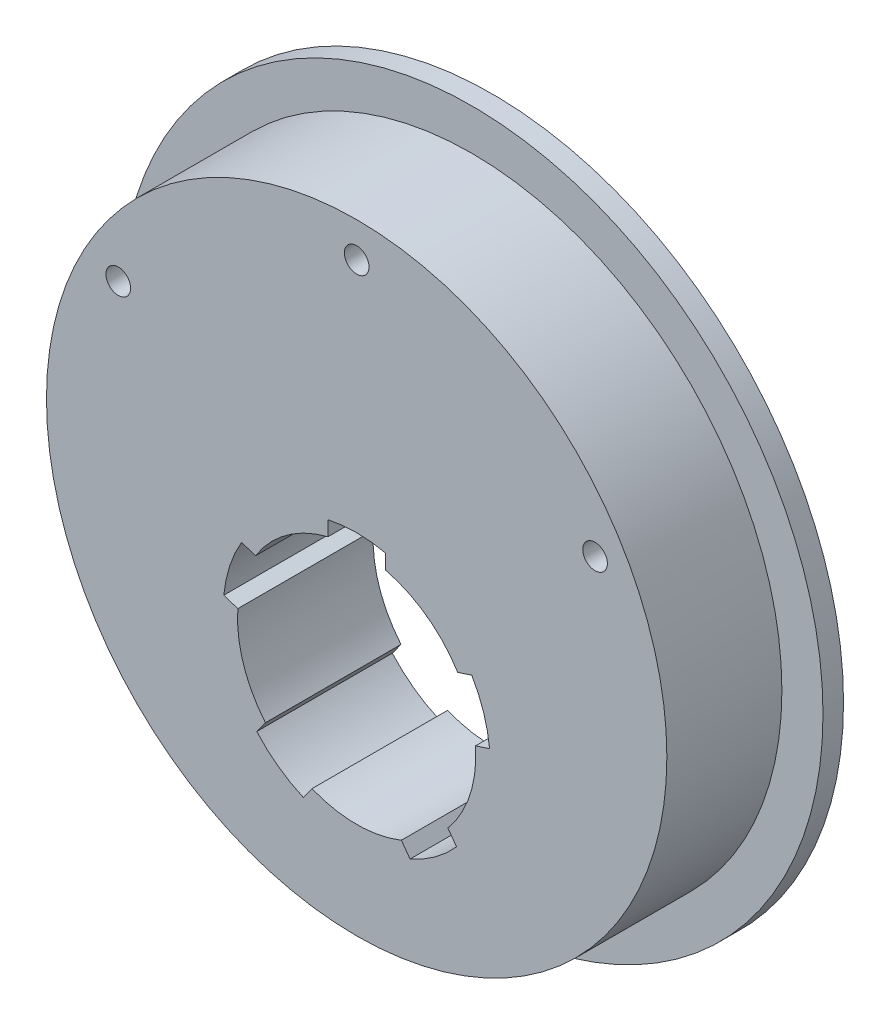
ISO-10303-21;
HEADER;
FILE_DESCRIPTION(('STEP AP214'),'2;1');
FILE_NAME('part.step','',(''),(''),'','','');
FILE_SCHEMA(('AUTOMOTIVE_DESIGN { 1 0 10303 214 1 1 1 1 }'));
ENDSEC;
DATA;
#1=APPLICATION_CONTEXT('core data for automotive mechanical design processes');
#2=APPLICATION_PROTOCOL_DEFINITION('international standard','automotive_design',2000,#1);
#3=PRODUCT_CONTEXT('',#1,'mechanical');
#4=PRODUCT('Part','Part','',(#3));
#5=PRODUCT_RELATED_PRODUCT_CATEGORY('part','',(#4));
#6=PRODUCT_DEFINITION_FORMATION('','',#4);
#7=PRODUCT_DEFINITION_CONTEXT('part definition',#1,'design');
#8=PRODUCT_DEFINITION('design','',#6,#7);
#9=PRODUCT_DEFINITION_SHAPE('','',#8);
#10=(LENGTH_UNIT() NAMED_UNIT(*) SI_UNIT(.MILLI.,.METRE.));
#11=(NAMED_UNIT(*) PLANE_ANGLE_UNIT() SI_UNIT($,.RADIAN.));
#12=(NAMED_UNIT(*) SI_UNIT($,.STERADIAN.) SOLID_ANGLE_UNIT());
#13=UNCERTAINTY_MEASURE_WITH_UNIT(LENGTH_MEASURE(1.E-05),#10,'distance_accuracy_value','');
#14=(GEOMETRIC_REPRESENTATION_CONTEXT(3) GLOBAL_UNCERTAINTY_ASSIGNED_CONTEXT((#13)) GLOBAL_UNIT_ASSIGNED_CONTEXT((#10,
#11,#12)) REPRESENTATION_CONTEXT('',''));
#15=CARTESIAN_POINT('',(0.,0.,0.));
#16=DIRECTION('',(0.,0.,1.));
#17=DIRECTION('',(1.,0.,0.));
#18=AXIS2_PLACEMENT_3D('',#15,#16,#17);
#19=CARTESIAN_POINT('',(0.,-23.,0.));
#20=DIRECTION('',(0.,0.,1.));
#21=DIRECTION('',(1.,0.,0.));
#22=AXIS2_PLACEMENT_3D('',#19,#20,#21);
#23=CYLINDRICAL_SURFACE('',#22,29.);
#24=CARTESIAN_POINT('',(0.,-23.,0.));
#25=DIRECTION('',(0.,0.,1.));
#26=DIRECTION('',(1.,0.,0.));
#27=AXIS2_PLACEMENT_3D('',#24,#25,#26);
#28=CIRCLE('',#27,29.);
#29=CARTESIAN_POINT('',(-28.928221795706,-20.960886531249,0.));
#30=VERTEX_POINT('',#29);
#31=CARTESIAN_POINT('',(-22.204862225091,-41.6532595962402,0.));
#32=VERTEX_POINT('',#31);
#33=EDGE_CURVE('E175',#30,#32,#28,.T.);
#34=ORIENTED_EDGE('',*,*,#33,.F.);
#35=DIRECTION('',(0.,0.,1.));
#36=VECTOR('',#35,1.);
#37=CARTESIAN_POINT('',(-28.928221795706,-20.960886531249,0.));
#38=LINE('',#37,#36);
#39=CARTESIAN_POINT('',(-28.928221795706,-20.960886531249,33.));
#40=VERTEX_POINT('',#39);
#41=EDGE_CURVE('E235',#30,#40,#38,.T.);
#42=ORIENTED_EDGE('',*,*,#41,.T.);
#43=CARTESIAN_POINT('',(0.,-23.,33.));
#44=DIRECTION('',(0.,0.,1.));
#45=DIRECTION('',(1.,0.,0.));
#46=AXIS2_PLACEMENT_3D('',#43,#44,#45);
#47=CIRCLE('',#46,29.);
#48=CARTESIAN_POINT('',(-22.204862225091,-41.6532595962402,33.));
#49=VERTEX_POINT('',#48);
#50=EDGE_CURVE('E177',#40,#49,#47,.T.);
#51=ORIENTED_EDGE('',*,*,#50,.T.);
#52=DIRECTION('',(0.,0.,1.));
#53=VECTOR('',#52,1.);
#54=CARTESIAN_POINT('',(-22.204862225091,-41.6532595962402,0.));
#55=LINE('',#54,#53);
#56=EDGE_CURVE('E159',#32,#49,#55,.T.);
#57=ORIENTED_EDGE('',*,*,#56,.F.);
#58=EDGE_LOOP('',(#34,#42,#51,#57));
#59=FACE_BOUND('',#58,.T.);
#60=ADVANCED_FACE('F39',(#59),#23,.F.);
#61=CARTESIAN_POINT('',(-10.8786243038417,-49.8822531283348,0.));
#62=VERTEX_POINT('',#61);
#63=CARTESIAN_POINT('',(10.878624303842,-49.8822531283346,0.));
#64=VERTEX_POINT('',#63);
#65=EDGE_CURVE('E189',#62,#64,#28,.T.);
#66=ORIENTED_EDGE('',*,*,#65,.F.);
#67=DIRECTION('',(0.,0.,1.));
#68=VECTOR('',#67,1.);
#69=CARTESIAN_POINT('',(-10.8786243038417,-49.8822531283348,0.));
#70=LINE('',#69,#68);
#71=CARTESIAN_POINT('',(-10.8786243038417,-49.8822531283348,33.));
#72=VERTEX_POINT('',#71);
#73=EDGE_CURVE('E319',#62,#72,#70,.T.);
#74=ORIENTED_EDGE('',*,*,#73,.T.);
#75=CARTESIAN_POINT('',(10.878624303842,-49.8822531283346,33.));
#76=VERTEX_POINT('',#75);
#77=EDGE_CURVE('E424',#72,#76,#47,.T.);
#78=ORIENTED_EDGE('',*,*,#77,.T.);
#79=DIRECTION('',(0.,0.,1.));
#80=VECTOR('',#79,1.);
#81=CARTESIAN_POINT('',(10.878624303842,-49.8822531283346,0.));
#82=LINE('',#81,#80);
#83=EDGE_CURVE('E366',#64,#76,#82,.T.);
#84=ORIENTED_EDGE('',*,*,#83,.F.);
#85=EDGE_LOOP('',(#66,#74,#78,#84));
#86=FACE_BOUND('',#85,.T.);
#87=ADVANCED_FACE('F457',(#86),#23,.F.);
#88=CARTESIAN_POINT('',(22.2048622250912,-41.6532595962399,0.));
#89=VERTEX_POINT('',#88);
#90=CARTESIAN_POINT('',(28.9282217957059,-20.9608865312486,0.));
#91=VERTEX_POINT('',#90);
#92=EDGE_CURVE('E197',#89,#91,#28,.T.);
#93=ORIENTED_EDGE('',*,*,#92,.F.);
#94=DIRECTION('',(0.,0.,1.));
#95=VECTOR('',#94,1.);
#96=CARTESIAN_POINT('',(22.2048622250912,-41.6532595962399,0.));
#97=LINE('',#96,#95);
#98=CARTESIAN_POINT('',(22.2048622250912,-41.6532595962399,33.));
#99=VERTEX_POINT('',#98);
#100=EDGE_CURVE('E170',#89,#99,#97,.T.);
#101=ORIENTED_EDGE('',*,*,#100,.T.);
#102=CARTESIAN_POINT('',(28.9282217957059,-20.9608865312486,33.));
#103=VERTEX_POINT('',#102);
#104=EDGE_CURVE('E220',#99,#103,#47,.T.);
#105=ORIENTED_EDGE('',*,*,#104,.T.);
#106=DIRECTION('',(0.,0.,1.));
#107=VECTOR('',#106,1.);
#108=CARTESIAN_POINT('',(28.9282217957059,-20.9608865312486,0.));
#109=LINE('',#108,#107);
#110=EDGE_CURVE('E391',#91,#103,#109,.T.);
#111=ORIENTED_EDGE('',*,*,#110,.F.);
#112=EDGE_LOOP('',(#93,#101,#105,#111));
#113=FACE_BOUND('',#112,.T.);
#114=ADVANCED_FACE('F434',(#113),#23,.F.);
#115=CARTESIAN_POINT('',(24.6019838744565,-7.64609530311651,0.));
#116=VERTEX_POINT('',#115);
#117=CARTESIAN_POINT('',(7.,5.14249455894058,0.));
#118=VERTEX_POINT('',#117);
#119=EDGE_CURVE('E195',#116,#118,#28,.T.);
#120=ORIENTED_EDGE('',*,*,#119,.F.);
#121=DIRECTION('',(0.,0.,1.));
#122=VECTOR('',#121,1.);
#123=CARTESIAN_POINT('',(24.6019838744565,-7.64609530311651,0.));
#124=LINE('',#123,#122);
#125=CARTESIAN_POINT('',(24.6019838744565,-7.64609530311651,33.));
#126=VERTEX_POINT('',#125);
#127=EDGE_CURVE('E358',#116,#126,#124,.T.);
#128=ORIENTED_EDGE('',*,*,#127,.T.);
#129=CARTESIAN_POINT('',(7.,5.14249455894058,33.));
#130=VERTEX_POINT('',#129);
#131=EDGE_CURVE('E217',#126,#130,#47,.T.);
#132=ORIENTED_EDGE('',*,*,#131,.T.);
#133=DIRECTION('',(0.,0.,1.));
#134=VECTOR('',#133,1.);
#135=CARTESIAN_POINT('',(7.,5.14249455894058,0.));
#136=LINE('',#135,#134);
#137=EDGE_CURVE('E279',#118,#130,#136,.T.);
#138=ORIENTED_EDGE('',*,*,#137,.F.);
#139=EDGE_LOOP('',(#120,#128,#132,#138));
#140=FACE_BOUND('',#139,.T.);
#141=ADVANCED_FACE('F417',(#140),#23,.F.);
#142=CARTESIAN_POINT('',(0.,0.,5.));
#143=DIRECTION('',(0.,0.,-1.));
#144=DIRECTION('',(-1.,0.,0.));
#145=AXIS2_PLACEMENT_3D('',#142,#143,#144);
#146=CYLINDRICAL_SURFACE('',#145,85.5);
#147=CARTESIAN_POINT('',(0.,0.,5.));
#148=DIRECTION('',(0.,0.,1.));
#149=DIRECTION('',(1.,0.,0.));
#150=AXIS2_PLACEMENT_3D('',#147,#148,#149);
#151=CIRCLE('',#150,85.5);
#152=CARTESIAN_POINT('',(85.5,0.,5.));
#153=VERTEX_POINT('',#152);
#154=EDGE_CURVE('E210',#153,#153,#151,.T.);
#155=ORIENTED_EDGE('',*,*,#154,.F.);
#156=EDGE_LOOP('',(#155));
#157=FACE_BOUND('',#156,.T.);
#158=CARTESIAN_POINT('',(0.,0.,0.));
#159=DIRECTION('',(0.,0.,1.));
#160=DIRECTION('',(1.,0.,0.));
#161=AXIS2_PLACEMENT_3D('',#158,#159,#160);
#162=CIRCLE('',#161,85.5);
#163=CARTESIAN_POINT('',(85.5,0.,0.));
#164=VERTEX_POINT('',#163);
#165=EDGE_CURVE('E204',#164,#164,#162,.T.);
#166=ORIENTED_EDGE('',*,*,#165,.T.);
#167=EDGE_LOOP('',(#166));
#168=FACE_BOUND('',#167,.T.);
#169=ADVANCED_FACE('F41',(#157,#168),#146,.T.);
#170=CARTESIAN_POINT('',(0.,0.,5.));
#171=DIRECTION('',(0.,0.,1.));
#172=DIRECTION('',(1.,0.,0.));
#173=AXIS2_PLACEMENT_3D('',#170,#171,#172);
#174=PLANE('',#173);
#175=CARTESIAN_POINT('',(0.,0.,5.));
#176=DIRECTION('',(0.,0.,1.));
#177=DIRECTION('',(1.,0.,0.));
#178=AXIS2_PLACEMENT_3D('',#175,#176,#177);
#179=CIRCLE('',#178,75.5);
#180=CARTESIAN_POINT('',(75.5,0.,5.));
#181=VERTEX_POINT('',#180);
#182=EDGE_CURVE('E205',#181,#181,#179,.T.);
#183=ORIENTED_EDGE('',*,*,#182,.F.);
#184=EDGE_LOOP('',(#183));
#185=FACE_BOUND('',#184,.T.);
#186=ORIENTED_EDGE('',*,*,#154,.T.);
#187=EDGE_LOOP('',(#186));
#188=FACE_BOUND('',#187,.T.);
#189=ADVANCED_FACE('F503',(#185,#188),#174,.T.);
#190=CARTESIAN_POINT('',(0.,0.,0.));
#191=DIRECTION('',(0.,0.,1.));
#192=DIRECTION('',(1.,0.,0.));
#193=AXIS2_PLACEMENT_3D('',#190,#191,#192);
#194=PLANE('',#193);
#195=CARTESIAN_POINT('',(0.,-23.,0.));
#196=DIRECTION('',(0.,0.,1.));
#197=DIRECTION('',(0.309016994374945,0.951056516295155,0.));
#198=AXIS2_PLACEMENT_3D('',#195,#196,#197);
#199=CIRCLE('',#198,32.5);
#200=CARTESIAN_POINT('',(-28.0207539484652,-6.5352695691799,0.));
#201=VERTEX_POINT('',#200);
#202=CARTESIAN_POINT('',(-32.3469918697144,-19.8500607973121,0.));
#203=VERTEX_POINT('',#202);
#204=EDGE_CURVE('E315',#201,#203,#199,.T.);
#205=ORIENTED_EDGE('',*,*,#204,.T.);
#206=DIRECTION('',(0.951056516295155,-0.309016994374945,0.));
#207=VECTOR('',#206,1.);
#208=CARTESIAN_POINT('',(-32.3469918697144,-19.8500607973121,0.));
#209=LINE('',#208,#207);
#210=EDGE_CURVE('E186',#203,#30,#209,.T.);
#211=ORIENTED_EDGE('',*,*,#210,.T.);
#212=ORIENTED_EDGE('',*,*,#33,.T.);
#213=DIRECTION('',(-0.587785252292468,-0.809016994374951,0.));
#214=VECTOR('',#213,1.);
#215=CARTESIAN_POINT('',(-24.3177783305491,-44.5614391232653,0.));
#216=LINE('',#215,#214);
#217=CARTESIAN_POINT('',(-24.3177783305491,-44.5614391232653,0.));
#218=VERTEX_POINT('',#217);
#219=EDGE_CURVE('E156',#32,#218,#216,.T.);
#220=ORIENTED_EDGE('',*,*,#219,.T.);
#221=CARTESIAN_POINT('',(0.,-23.,0.));
#222=DIRECTION('',(0.,0.,1.));
#223=DIRECTION('',(-0.809016994374951,0.587785252292469,0.));
#224=AXIS2_PLACEMENT_3D('',#221,#222,#223);
#225=CIRCLE('',#224,32.5);
#226=CARTESIAN_POINT('',(-12.9915404092998,-52.7904326553598,0.));
#227=VERTEX_POINT('',#226);
#228=EDGE_CURVE('E169',#218,#227,#225,.T.);
#229=ORIENTED_EDGE('',*,*,#228,.T.);
#230=DIRECTION('',(0.587785252292468,0.809016994374951,0.));
#231=VECTOR('',#230,1.);
#232=CARTESIAN_POINT('',(-12.9915404092998,-52.7904326553598,0.));
#233=LINE('',#232,#231);
#234=EDGE_CURVE('E179',#227,#62,#233,.T.);
#235=ORIENTED_EDGE('',*,*,#234,.T.);
#236=ORIENTED_EDGE('',*,*,#65,.T.);
#237=DIRECTION('',(0.58778525229248,-0.809016994374942,0.));
#238=VECTOR('',#237,1.);
#239=CARTESIAN_POINT('',(12.9915404093003,-52.7904326553596,0.));
#240=LINE('',#239,#238);
#241=CARTESIAN_POINT('',(12.9915404093003,-52.7904326553596,0.));
#242=VERTEX_POINT('',#241);
#243=EDGE_CURVE('E353',#64,#242,#240,.T.);
#244=ORIENTED_EDGE('',*,*,#243,.T.);
#245=CARTESIAN_POINT('',(0.,-23.,0.));
#246=DIRECTION('',(0.,0.,1.));
#247=DIRECTION('',(-0.809016994374942,-0.58778525229248,0.));
#248=AXIS2_PLACEMENT_3D('',#245,#246,#247);
#249=CIRCLE('',#248,32.5);
#250=CARTESIAN_POINT('',(24.3177783305495,-44.5614391232649,0.));
#251=VERTEX_POINT('',#250);
#252=EDGE_CURVE('E357',#242,#251,#249,.T.);
#253=ORIENTED_EDGE('',*,*,#252,.T.);
#254=DIRECTION('',(-0.58778525229248,0.809016994374942,0.));
#255=VECTOR('',#254,1.);
#256=CARTESIAN_POINT('',(24.3177783305495,-44.5614391232649,0.));
#257=LINE('',#256,#255);
#258=EDGE_CURVE('E362',#251,#89,#257,.T.);
#259=ORIENTED_EDGE('',*,*,#258,.T.);
#260=ORIENTED_EDGE('',*,*,#92,.T.);
#261=DIRECTION('',(0.95105651629515,0.309016994374958,0.));
#262=VECTOR('',#261,1.);
#263=CARTESIAN_POINT('',(32.3469918697144,-19.8500607973116,0.));
#264=LINE('',#263,#262);
#265=CARTESIAN_POINT('',(32.3469918697144,-19.8500607973116,0.));
#266=VERTEX_POINT('',#265);
#267=EDGE_CURVE('E58',#91,#266,#264,.T.);
#268=ORIENTED_EDGE('',*,*,#267,.T.);
#269=CARTESIAN_POINT('',(0.,-23.,0.));
#270=DIRECTION('',(0.,0.,1.));
#271=DIRECTION('',(0.309016994374958,-0.95105651629515,0.));
#272=AXIS2_PLACEMENT_3D('',#269,#270,#271);
#273=CIRCLE('',#272,32.5);
#274=CARTESIAN_POINT('',(28.0207539484649,-6.53526956917951,0.));
#275=VERTEX_POINT('',#274);
#276=EDGE_CURVE('E382',#266,#275,#273,.T.);
#277=ORIENTED_EDGE('',*,*,#276,.T.);
#278=DIRECTION('',(-0.95105651629515,-0.309016994374958,0.));
#279=VECTOR('',#278,1.);
#280=CARTESIAN_POINT('',(28.0207539484649,-6.53526956917951,0.));
#281=LINE('',#280,#279);
#282=EDGE_CURVE('E387',#275,#116,#281,.T.);
#283=ORIENTED_EDGE('',*,*,#282,.T.);
#284=ORIENTED_EDGE('',*,*,#119,.T.);
#285=DIRECTION('',(0.,1.,0.));
#286=VECTOR('',#285,1.);
#287=CARTESIAN_POINT('',(7.,8.7372021451167,0.));
#288=LINE('',#287,#286);
#289=CARTESIAN_POINT('',(7.,8.7372021451167,0.));
#290=VERTEX_POINT('',#289);
#291=EDGE_CURVE('E263',#118,#290,#288,.T.);
#292=ORIENTED_EDGE('',*,*,#291,.T.);
#293=CARTESIAN_POINT('',(0.,-23.,0.));
#294=DIRECTION('',(0.,0.,1.));
#295=DIRECTION('',(1.,0.,0.));
#296=AXIS2_PLACEMENT_3D('',#293,#294,#295);
#297=CIRCLE('',#296,32.5);
#298=CARTESIAN_POINT('',(-7.,8.7372021451167,0.));
#299=VERTEX_POINT('',#298);
#300=EDGE_CURVE('E266',#290,#299,#297,.T.);
#301=ORIENTED_EDGE('',*,*,#300,.T.);
#302=DIRECTION('',(0.,-1.,0.));
#303=VECTOR('',#302,1.);
#304=CARTESIAN_POINT('',(-7.,8.7372021451167,0.));
#305=LINE('',#304,#303);
#306=CARTESIAN_POINT('',(-7.,5.14249455894058,0.));
#307=VERTEX_POINT('',#306);
#308=EDGE_CURVE('E270',#299,#307,#305,.T.);
#309=ORIENTED_EDGE('',*,*,#308,.T.);
#310=CARTESIAN_POINT('',(-24.6019838744568,-7.64609530311686,0.));
#311=VERTEX_POINT('',#310);
#312=EDGE_CURVE('E188',#307,#311,#28,.T.);
#313=ORIENTED_EDGE('',*,*,#312,.T.);
#314=DIRECTION('',(-0.951056516295155,0.309016994374945,0.));
#315=VECTOR('',#314,1.);
#316=CARTESIAN_POINT('',(-28.0207539484652,-6.5352695691799,0.));
#317=LINE('',#316,#315);
#318=EDGE_CURVE('E312',#311,#201,#317,.T.);
#319=ORIENTED_EDGE('',*,*,#318,.T.);
#320=EDGE_LOOP('',(#205,#211,#212,#220,#229,#235,#236,#244,#253,#259,#260,#268,#277,#283,#284,
#292,#301,#309,#313,#319));
#321=FACE_BOUND('',#320,.T.);
#322=ORIENTED_EDGE('',*,*,#165,.F.);
#323=EDGE_LOOP('',(#322));
#324=FACE_BOUND('',#323,.T.);
#325=ADVANCED_FACE('F183',(#321,#324),#194,.F.);
#326=CARTESIAN_POINT('',(0.,0.,33.));
#327=DIRECTION('',(0.,0.,-1.));
#328=DIRECTION('',(-1.,0.,0.));
#329=AXIS2_PLACEMENT_3D('',#326,#327,#328);
#330=CYLINDRICAL_SURFACE('',#329,75.5);
#331=CARTESIAN_POINT('',(0.,0.,33.));
#332=DIRECTION('',(0.,0.,1.));
#333=DIRECTION('',(1.,0.,0.));
#334=AXIS2_PLACEMENT_3D('',#331,#332,#333);
#335=CIRCLE('',#334,75.5);
#336=CARTESIAN_POINT('',(75.5,0.,33.));
#337=VERTEX_POINT('',#336);
#338=EDGE_CURVE('E194',#337,#337,#335,.T.);
#339=ORIENTED_EDGE('',*,*,#338,.F.);
#340=EDGE_LOOP('',(#339));
#341=FACE_BOUND('',#340,.T.);
#342=ORIENTED_EDGE('',*,*,#182,.T.);
#343=EDGE_LOOP('',(#342));
#344=FACE_BOUND('',#343,.T.);
#345=ADVANCED_FACE('F496',(#341,#344),#330,.T.);
#346=CARTESIAN_POINT('',(0.,0.,33.));
#347=DIRECTION('',(0.,0.,1.));
#348=DIRECTION('',(1.,0.,0.));
#349=AXIS2_PLACEMENT_3D('',#346,#347,#348);
#350=PLANE('',#349);
#351=CARTESIAN_POINT('',(58.0237020535575,33.4999999999999,33.));
#352=DIRECTION('',(0.,0.,1.));
#353=DIRECTION('',(0.499999999999998,-0.86602540378444,0.));
#354=AXIS2_PLACEMENT_3D('',#351,#352,#353);
#355=CIRCLE('',#354,3.);
#356=CARTESIAN_POINT('',(59.5237020535575,30.9019237886465,33.));
#357=VERTEX_POINT('',#356);
#358=EDGE_CURVE('E738',#357,#357,#355,.T.);
#359=ORIENTED_EDGE('',*,*,#358,.F.);
#360=EDGE_LOOP('',(#359));
#361=FACE_BOUND('',#360,.T.);
#362=CARTESIAN_POINT('',(-58.0237020535575,33.4999999999999,33.));
#363=DIRECTION('',(0.,0.,1.));
#364=DIRECTION('',(0.499999999999998,0.86602540378444,0.));
#365=AXIS2_PLACEMENT_3D('',#362,#363,#364);
#366=CIRCLE('',#365,3.);
#367=CARTESIAN_POINT('',(-56.5237020535575,36.0980762113532,33.));
#368=VERTEX_POINT('',#367);
#369=EDGE_CURVE('E737',#368,#368,#366,.T.);
#370=ORIENTED_EDGE('',*,*,#369,.F.);
#371=EDGE_LOOP('',(#370));
#372=FACE_BOUND('',#371,.T.);
#373=CARTESIAN_POINT('',(0.,67.,33.));
#374=DIRECTION('',(0.,0.,1.));
#375=DIRECTION('',(1.,0.,0.));
#376=AXIS2_PLACEMENT_3D('',#373,#374,#375);
#377=CIRCLE('',#376,3.);
#378=CARTESIAN_POINT('',(3.,67.,33.));
#379=VERTEX_POINT('',#378);
#380=EDGE_CURVE('E328',#379,#379,#377,.T.);
#381=ORIENTED_EDGE('',*,*,#380,.F.);
#382=EDGE_LOOP('',(#381));
#383=FACE_BOUND('',#382,.T.);
#384=DIRECTION('',(0.951056516295155,-0.309016994374944,0.));
#385=VECTOR('',#384,1.);
#386=CARTESIAN_POINT('',(-32.3469918697144,-19.8500607973121,33.));
#387=LINE('',#386,#385);
#388=CARTESIAN_POINT('',(-32.3469918697144,-19.8500607973121,33.));
#389=VERTEX_POINT('',#388);
#390=EDGE_CURVE('E43',#389,#40,#387,.T.);
#391=ORIENTED_EDGE('',*,*,#390,.F.);
#392=CARTESIAN_POINT('',(0.,-23.,33.));
#393=DIRECTION('',(0.,0.,1.));
#394=DIRECTION('',(1.,0.,0.));
#395=AXIS2_PLACEMENT_3D('',#392,#393,#394);
#396=CIRCLE('',#395,32.5);
#397=CARTESIAN_POINT('',(-28.0207539484652,-6.53526956917991,33.));
#398=VERTEX_POINT('',#397);
#399=EDGE_CURVE('E11',#398,#389,#396,.T.);
#400=ORIENTED_EDGE('',*,*,#399,.F.);
#401=DIRECTION('',(-0.951056516295155,0.309016994374944,0.));
#402=VECTOR('',#401,1.);
#403=CARTESIAN_POINT('',(-28.0207539484652,-6.5352695691799,33.));
#404=LINE('',#403,#402);
#405=CARTESIAN_POINT('',(-24.6019838744567,-7.64609530311686,33.));
#406=VERTEX_POINT('',#405);
#407=EDGE_CURVE('E257',#406,#398,#404,.T.);
#408=ORIENTED_EDGE('',*,*,#407,.F.);
#409=CARTESIAN_POINT('',(-7.,5.14249455894058,33.));
#410=VERTEX_POINT('',#409);
#411=EDGE_CURVE('E301',#410,#406,#47,.T.);
#412=ORIENTED_EDGE('',*,*,#411,.F.);
#413=DIRECTION('',(0.,-1.,0.));
#414=VECTOR('',#413,1.);
#415=CARTESIAN_POINT('',(-7.,8.7372021451167,33.));
#416=LINE('',#415,#414);
#417=CARTESIAN_POINT('',(-7.,8.7372021451167,33.));
#418=VERTEX_POINT('',#417);
#419=EDGE_CURVE('E221',#418,#410,#416,.T.);
#420=ORIENTED_EDGE('',*,*,#419,.F.);
#421=CARTESIAN_POINT('',(0.,-23.,33.));
#422=DIRECTION('',(0.,0.,1.));
#423=DIRECTION('',(1.,0.,0.));
#424=AXIS2_PLACEMENT_3D('',#421,#422,#423);
#425=CIRCLE('',#424,32.5);
#426=CARTESIAN_POINT('',(7.,8.7372021451167,33.));
#427=VERTEX_POINT('',#426);
#428=EDGE_CURVE('E209',#427,#418,#425,.T.);
#429=ORIENTED_EDGE('',*,*,#428,.F.);
#430=DIRECTION('',(0.,1.,0.));
#431=VECTOR('',#430,1.);
#432=CARTESIAN_POINT('',(7.,8.7372021451167,33.));
#433=LINE('',#432,#431);
#434=EDGE_CURVE('E222',#130,#427,#433,.T.);
#435=ORIENTED_EDGE('',*,*,#434,.F.);
#436=ORIENTED_EDGE('',*,*,#131,.F.);
#437=DIRECTION('',(-0.95105651629515,-0.309016994374958,0.));
#438=VECTOR('',#437,1.);
#439=CARTESIAN_POINT('',(28.0207539484649,-6.53526956917951,33.));
#440=LINE('',#439,#438);
#441=CARTESIAN_POINT('',(28.0207539484649,-6.5352695691795,33.));
#442=VERTEX_POINT('',#441);
#443=EDGE_CURVE('E234',#442,#126,#440,.T.);
#444=ORIENTED_EDGE('',*,*,#443,.F.);
#445=CARTESIAN_POINT('',(0.,-23.,33.));
#446=DIRECTION('',(0.,0.,1.));
#447=DIRECTION('',(1.,0.,0.));
#448=AXIS2_PLACEMENT_3D('',#445,#446,#447);
#449=CIRCLE('',#448,32.5);
#450=CARTESIAN_POINT('',(32.3469918697144,-19.8500607973116,33.));
#451=VERTEX_POINT('',#450);
#452=EDGE_CURVE('E228',#451,#442,#449,.T.);
#453=ORIENTED_EDGE('',*,*,#452,.F.);
#454=DIRECTION('',(0.95105651629515,0.309016994374958,0.));
#455=VECTOR('',#454,1.);
#456=CARTESIAN_POINT('',(32.3469918697144,-19.8500607973116,33.));
#457=LINE('',#456,#455);
#458=EDGE_CURVE('E231',#103,#451,#457,.T.);
#459=ORIENTED_EDGE('',*,*,#458,.F.);
#460=ORIENTED_EDGE('',*,*,#104,.F.);
#461=DIRECTION('',(-0.58778525229248,0.809016994374942,0.));
#462=VECTOR('',#461,1.);
#463=CARTESIAN_POINT('',(24.3177783305495,-44.5614391232649,33.));
#464=LINE('',#463,#462);
#465=CARTESIAN_POINT('',(24.3177783305495,-44.5614391232649,33.));
#466=VERTEX_POINT('',#465);
#467=EDGE_CURVE('E244',#466,#99,#464,.T.);
#468=ORIENTED_EDGE('',*,*,#467,.F.);
#469=CARTESIAN_POINT('',(0.,-23.,33.));
#470=DIRECTION('',(0.,0.,1.));
#471=DIRECTION('',(1.,0.,0.));
#472=AXIS2_PLACEMENT_3D('',#469,#470,#471);
#473=CIRCLE('',#472,32.5);
#474=CARTESIAN_POINT('',(12.9915404093003,-52.7904326553596,33.));
#475=VERTEX_POINT('',#474);
#476=EDGE_CURVE('E238',#475,#466,#473,.T.);
#477=ORIENTED_EDGE('',*,*,#476,.F.);
#478=DIRECTION('',(0.58778525229248,-0.809016994374942,0.));
#479=VECTOR('',#478,1.);
#480=CARTESIAN_POINT('',(12.9915404093003,-52.7904326553596,33.));
#481=LINE('',#480,#479);
#482=EDGE_CURVE('E241',#76,#475,#481,.T.);
#483=ORIENTED_EDGE('',*,*,#482,.F.);
#484=ORIENTED_EDGE('',*,*,#77,.F.);
#485=DIRECTION('',(0.587785252292468,0.809016994374951,0.));
#486=VECTOR('',#485,1.);
#487=CARTESIAN_POINT('',(-12.9915404092998,-52.7904326553598,33.));
#488=LINE('',#487,#486);
#489=CARTESIAN_POINT('',(-12.9915404092998,-52.7904326553598,33.));
#490=VERTEX_POINT('',#489);
#491=EDGE_CURVE('E252',#490,#72,#488,.T.);
#492=ORIENTED_EDGE('',*,*,#491,.F.);
#493=CARTESIAN_POINT('',(0.,-23.,33.));
#494=DIRECTION('',(0.,0.,1.));
#495=DIRECTION('',(1.,0.,0.));
#496=AXIS2_PLACEMENT_3D('',#493,#494,#495);
#497=CIRCLE('',#496,32.5);
#498=CARTESIAN_POINT('',(-24.3177783305491,-44.5614391232653,33.));
#499=VERTEX_POINT('',#498);
#500=EDGE_CURVE('E50',#499,#490,#497,.T.);
#501=ORIENTED_EDGE('',*,*,#500,.F.);
#502=DIRECTION('',(-0.587785252292468,-0.809016994374951,0.));
#503=VECTOR('',#502,1.);
#504=CARTESIAN_POINT('',(-24.3177783305491,-44.5614391232653,33.));
#505=LINE('',#504,#503);
#506=EDGE_CURVE('E249',#49,#499,#505,.T.);
#507=ORIENTED_EDGE('',*,*,#506,.F.);
#508=ORIENTED_EDGE('',*,*,#50,.F.);
#509=EDGE_LOOP('',(#391,#400,#408,#412,#420,#429,#435,#436,#444,#453,#459,#460,#468,#477,#483,
#484,#492,#501,#507,#508));
#510=FACE_BOUND('',#509,.T.);
#511=ORIENTED_EDGE('',*,*,#338,.T.);
#512=EDGE_LOOP('',(#511));
#513=FACE_BOUND('',#512,.T.);
#514=ADVANCED_FACE('F296',(#361,#372,#383,#510,#513),#350,.T.);
#515=ORIENTED_EDGE('',*,*,#411,.T.);
#516=DIRECTION('',(0.,0.,1.));
#517=VECTOR('',#516,1.);
#518=CARTESIAN_POINT('',(-24.6019838744568,-7.64609530311686,0.));
#519=LINE('',#518,#517);
#520=EDGE_CURVE('E309',#311,#406,#519,.T.);
#521=ORIENTED_EDGE('',*,*,#520,.F.);
#522=ORIENTED_EDGE('',*,*,#312,.F.);
#523=DIRECTION('',(0.,0.,1.));
#524=VECTOR('',#523,1.);
#525=CARTESIAN_POINT('',(-7.,5.14249455894058,0.));
#526=LINE('',#525,#524);
#527=EDGE_CURVE('E225',#307,#410,#526,.T.);
#528=ORIENTED_EDGE('',*,*,#527,.T.);
#529=EDGE_LOOP('',(#515,#521,#522,#528));
#530=FACE_BOUND('',#529,.T.);
#531=ADVANCED_FACE('F307',(#530),#23,.F.);
#532=CARTESIAN_POINT('',(-7.,8.7372021451167,0.));
#533=DIRECTION('',(-1.,0.,0.));
#534=DIRECTION('',(0.,-1.,0.));
#535=AXIS2_PLACEMENT_3D('',#532,#533,#534);
#536=PLANE('',#535);
#537=ORIENTED_EDGE('',*,*,#419,.T.);
#538=ORIENTED_EDGE('',*,*,#527,.F.);
#539=ORIENTED_EDGE('',*,*,#308,.F.);
#540=DIRECTION('',(0.,0.,1.));
#541=VECTOR('',#540,1.);
#542=CARTESIAN_POINT('',(-7.,8.7372021451167,0.));
#543=LINE('',#542,#541);
#544=EDGE_CURVE('E280',#299,#418,#543,.T.);
#545=ORIENTED_EDGE('',*,*,#544,.T.);
#546=EDGE_LOOP('',(#537,#538,#539,#545));
#547=FACE_BOUND('',#546,.T.);
#548=ADVANCED_FACE('F303',(#547),#536,.F.);
#549=CARTESIAN_POINT('',(0.,-23.,0.));
#550=DIRECTION('',(0.,0.,1.));
#551=DIRECTION('',(1.,0.,0.));
#552=AXIS2_PLACEMENT_3D('',#549,#550,#551);
#553=CYLINDRICAL_SURFACE('',#552,32.5);
#554=ORIENTED_EDGE('',*,*,#428,.T.);
#555=ORIENTED_EDGE('',*,*,#544,.F.);
#556=ORIENTED_EDGE('',*,*,#300,.F.);
#557=DIRECTION('',(0.,0.,1.));
#558=VECTOR('',#557,1.);
#559=CARTESIAN_POINT('',(7.,8.7372021451167,0.));
#560=LINE('',#559,#558);
#561=EDGE_CURVE('E125',#290,#427,#560,.T.);
#562=ORIENTED_EDGE('',*,*,#561,.T.);
#563=EDGE_LOOP('',(#554,#555,#556,#562));
#564=FACE_BOUND('',#563,.T.);
#565=ADVANCED_FACE('F293',(#564),#553,.F.);
#566=CARTESIAN_POINT('',(7.,8.7372021451167,0.));
#567=DIRECTION('',(1.,0.,0.));
#568=DIRECTION('',(0.,1.,0.));
#569=AXIS2_PLACEMENT_3D('',#566,#567,#568);
#570=PLANE('',#569);
#571=ORIENTED_EDGE('',*,*,#434,.T.);
#572=ORIENTED_EDGE('',*,*,#561,.F.);
#573=ORIENTED_EDGE('',*,*,#291,.F.);
#574=ORIENTED_EDGE('',*,*,#137,.T.);
#575=EDGE_LOOP('',(#571,#572,#573,#574));
#576=FACE_BOUND('',#575,.T.);
#577=ADVANCED_FACE('F521',(#576),#570,.F.);
#578=CARTESIAN_POINT('',(28.0207539484649,-6.53526956917951,0.));
#579=DIRECTION('',(-0.309016994374958,0.95105651629515,0.));
#580=DIRECTION('',(-0.95105651629515,-0.309016994374958,0.));
#581=AXIS2_PLACEMENT_3D('',#578,#579,#580);
#582=PLANE('',#581);
#583=ORIENTED_EDGE('',*,*,#443,.T.);
#584=ORIENTED_EDGE('',*,*,#127,.F.);
#585=ORIENTED_EDGE('',*,*,#282,.F.);
#586=DIRECTION('',(0.,0.,1.));
#587=VECTOR('',#586,1.);
#588=CARTESIAN_POINT('',(28.0207539484649,-6.53526956917951,0.));
#589=LINE('',#588,#587);
#590=EDGE_CURVE('E392',#275,#442,#589,.T.);
#591=ORIENTED_EDGE('',*,*,#590,.T.);
#592=EDGE_LOOP('',(#583,#584,#585,#591));
#593=FACE_BOUND('',#592,.T.);
#594=ADVANCED_FACE('F413',(#593),#582,.F.);
#595=CARTESIAN_POINT('',(0.,-23.,0.));
#596=DIRECTION('',(0.,0.,1.));
#597=DIRECTION('',(1.,0.,0.));
#598=AXIS2_PLACEMENT_3D('',#595,#596,#597);
#599=CYLINDRICAL_SURFACE('',#598,32.5);
#600=ORIENTED_EDGE('',*,*,#452,.T.);
#601=ORIENTED_EDGE('',*,*,#590,.F.);
#602=ORIENTED_EDGE('',*,*,#276,.F.);
#603=DIRECTION('',(0.,0.,1.));
#604=VECTOR('',#603,1.);
#605=CARTESIAN_POINT('',(32.3469918697144,-19.8500607973116,0.));
#606=LINE('',#605,#604);
#607=EDGE_CURVE('E273',#266,#451,#606,.T.);
#608=ORIENTED_EDGE('',*,*,#607,.T.);
#609=EDGE_LOOP('',(#600,#601,#602,#608));
#610=FACE_BOUND('',#609,.T.);
#611=ADVANCED_FACE('F405',(#610),#599,.F.);
#612=CARTESIAN_POINT('',(32.3469918697144,-19.8500607973116,0.));
#613=DIRECTION('',(0.309016994374958,-0.95105651629515,0.));
#614=DIRECTION('',(0.95105651629515,0.309016994374958,0.));
#615=AXIS2_PLACEMENT_3D('',#612,#613,#614);
#616=PLANE('',#615);
#617=ORIENTED_EDGE('',*,*,#458,.T.);
#618=ORIENTED_EDGE('',*,*,#607,.F.);
#619=ORIENTED_EDGE('',*,*,#267,.F.);
#620=ORIENTED_EDGE('',*,*,#110,.T.);
#621=EDGE_LOOP('',(#617,#618,#619,#620));
#622=FACE_BOUND('',#621,.T.);
#623=ADVANCED_FACE('F592',(#622),#616,.F.);
#624=CARTESIAN_POINT('',(24.3177783305495,-44.5614391232649,0.));
#625=DIRECTION('',(0.809016994374942,0.58778525229248,0.));
#626=DIRECTION('',(-0.58778525229248,0.809016994374942,0.));
#627=AXIS2_PLACEMENT_3D('',#624,#625,#626);
#628=PLANE('',#627);
#629=ORIENTED_EDGE('',*,*,#467,.T.);
#630=ORIENTED_EDGE('',*,*,#100,.F.);
#631=ORIENTED_EDGE('',*,*,#258,.F.);
#632=DIRECTION('',(0.,0.,1.));
#633=VECTOR('',#632,1.);
#634=CARTESIAN_POINT('',(24.3177783305495,-44.5614391232649,0.));
#635=LINE('',#634,#633);
#636=EDGE_CURVE('E367',#251,#466,#635,.T.);
#637=ORIENTED_EDGE('',*,*,#636,.T.);
#638=EDGE_LOOP('',(#629,#630,#631,#637));
#639=FACE_BOUND('',#638,.T.);
#640=ADVANCED_FACE('F440',(#639),#628,.F.);
#641=CARTESIAN_POINT('',(0.,-23.,0.));
#642=DIRECTION('',(0.,0.,1.));
#643=DIRECTION('',(1.,0.,0.));
#644=AXIS2_PLACEMENT_3D('',#641,#642,#643);
#645=CYLINDRICAL_SURFACE('',#644,32.5);
#646=ORIENTED_EDGE('',*,*,#476,.T.);
#647=ORIENTED_EDGE('',*,*,#636,.F.);
#648=ORIENTED_EDGE('',*,*,#252,.F.);
#649=DIRECTION('',(0.,0.,1.));
#650=VECTOR('',#649,1.);
#651=CARTESIAN_POINT('',(12.9915404093003,-52.7904326553596,0.));
#652=LINE('',#651,#650);
#653=EDGE_CURVE('E371',#242,#475,#652,.T.);
#654=ORIENTED_EDGE('',*,*,#653,.T.);
#655=EDGE_LOOP('',(#646,#647,#648,#654));
#656=FACE_BOUND('',#655,.T.);
#657=ADVANCED_FACE('F447',(#656),#645,.F.);
#658=CARTESIAN_POINT('',(12.9915404093003,-52.7904326553596,0.));
#659=DIRECTION('',(-0.809016994374942,-0.58778525229248,0.));
#660=DIRECTION('',(0.58778525229248,-0.809016994374942,0.));
#661=AXIS2_PLACEMENT_3D('',#658,#659,#660);
#662=PLANE('',#661);
#663=ORIENTED_EDGE('',*,*,#482,.T.);
#664=ORIENTED_EDGE('',*,*,#653,.F.);
#665=ORIENTED_EDGE('',*,*,#243,.F.);
#666=ORIENTED_EDGE('',*,*,#83,.T.);
#667=EDGE_LOOP('',(#663,#664,#665,#666));
#668=FACE_BOUND('',#667,.T.);
#669=ADVANCED_FACE('F456',(#668),#662,.F.);
#670=CARTESIAN_POINT('',(-12.9915404092998,-52.7904326553598,0.));
#671=DIRECTION('',(0.809016994374951,-0.587785252292468,0.));
#672=DIRECTION('',(0.587785252292468,0.809016994374951,0.));
#673=AXIS2_PLACEMENT_3D('',#670,#671,#672);
#674=PLANE('',#673);
#675=ORIENTED_EDGE('',*,*,#491,.T.);
#676=ORIENTED_EDGE('',*,*,#73,.F.);
#677=ORIENTED_EDGE('',*,*,#234,.F.);
#678=DIRECTION('',(0.,0.,1.));
#679=VECTOR('',#678,1.);
#680=CARTESIAN_POINT('',(-12.9915404092998,-52.7904326553598,0.));
#681=LINE('',#680,#679);
#682=EDGE_CURVE('E325',#227,#490,#681,.T.);
#683=ORIENTED_EDGE('',*,*,#682,.T.);
#684=EDGE_LOOP('',(#675,#676,#677,#683));
#685=FACE_BOUND('',#684,.T.);
#686=ADVANCED_FACE('F473',(#685),#674,.F.);
#687=CARTESIAN_POINT('',(0.,-23.,0.));
#688=DIRECTION('',(0.,0.,1.));
#689=DIRECTION('',(1.,0.,0.));
#690=AXIS2_PLACEMENT_3D('',#687,#688,#689);
#691=CYLINDRICAL_SURFACE('',#690,32.5);
#692=ORIENTED_EDGE('',*,*,#500,.T.);
#693=ORIENTED_EDGE('',*,*,#682,.F.);
#694=ORIENTED_EDGE('',*,*,#228,.F.);
#695=DIRECTION('',(0.,0.,1.));
#696=VECTOR('',#695,1.);
#697=CARTESIAN_POINT('',(-24.3177783305491,-44.5614391232653,0.));
#698=LINE('',#697,#696);
#699=EDGE_CURVE('E163',#218,#499,#698,.T.);
#700=ORIENTED_EDGE('',*,*,#699,.T.);
#701=EDGE_LOOP('',(#692,#693,#694,#700));
#702=FACE_BOUND('',#701,.T.);
#703=ADVANCED_FACE('F472',(#702),#691,.F.);
#704=CARTESIAN_POINT('',(-24.3177783305491,-44.5614391232653,0.));
#705=DIRECTION('',(-0.809016994374951,0.587785252292468,0.));
#706=DIRECTION('',(-0.587785252292468,-0.809016994374951,0.));
#707=AXIS2_PLACEMENT_3D('',#704,#705,#706);
#708=PLANE('',#707);
#709=ORIENTED_EDGE('',*,*,#506,.T.);
#710=ORIENTED_EDGE('',*,*,#699,.F.);
#711=ORIENTED_EDGE('',*,*,#219,.F.);
#712=ORIENTED_EDGE('',*,*,#56,.T.);
#713=EDGE_LOOP('',(#709,#710,#711,#712));
#714=FACE_BOUND('',#713,.T.);
#715=ADVANCED_FACE('F158',(#714),#708,.F.);
#716=CARTESIAN_POINT('',(-32.3469918697144,-19.8500607973121,0.));
#717=DIRECTION('',(-0.309016994374944,-0.951056516295155,0.));
#718=DIRECTION('',(0.951056516295155,-0.309016994374944,0.));
#719=AXIS2_PLACEMENT_3D('',#716,#717,#718);
#720=PLANE('',#719);
#721=ORIENTED_EDGE('',*,*,#390,.T.);
#722=ORIENTED_EDGE('',*,*,#41,.F.);
#723=ORIENTED_EDGE('',*,*,#210,.F.);
#724=DIRECTION('',(0.,0.,1.));
#725=VECTOR('',#724,1.);
#726=CARTESIAN_POINT('',(-32.3469918697144,-19.8500607973121,0.));
#727=LINE('',#726,#725);
#728=EDGE_CURVE('E333',#203,#389,#727,.T.);
#729=ORIENTED_EDGE('',*,*,#728,.T.);
#730=EDGE_LOOP('',(#721,#722,#723,#729));
#731=FACE_BOUND('',#730,.T.);
#732=ADVANCED_FACE('F468',(#731),#720,.F.);
#733=CARTESIAN_POINT('',(0.,-23.,0.));
#734=DIRECTION('',(0.,0.,1.));
#735=DIRECTION('',(1.,0.,0.));
#736=AXIS2_PLACEMENT_3D('',#733,#734,#735);
#737=CYLINDRICAL_SURFACE('',#736,32.5);
#738=ORIENTED_EDGE('',*,*,#399,.T.);
#739=ORIENTED_EDGE('',*,*,#728,.F.);
#740=ORIENTED_EDGE('',*,*,#204,.F.);
#741=DIRECTION('',(0.,0.,1.));
#742=VECTOR('',#741,1.);
#743=CARTESIAN_POINT('',(-28.0207539484652,-6.5352695691799,0.));
#744=LINE('',#743,#742);
#745=EDGE_CURVE('E336',#201,#398,#744,.T.);
#746=ORIENTED_EDGE('',*,*,#745,.T.);
#747=EDGE_LOOP('',(#738,#739,#740,#746));
#748=FACE_BOUND('',#747,.T.);
#749=ADVANCED_FACE('F467',(#748),#737,.F.);
#750=CARTESIAN_POINT('',(-28.0207539484652,-6.5352695691799,0.));
#751=DIRECTION('',(0.309016994374944,0.951056516295155,0.));
#752=DIRECTION('',(-0.951056516295155,0.309016994374944,0.));
#753=AXIS2_PLACEMENT_3D('',#750,#751,#752);
#754=PLANE('',#753);
#755=ORIENTED_EDGE('',*,*,#407,.T.);
#756=ORIENTED_EDGE('',*,*,#745,.F.);
#757=ORIENTED_EDGE('',*,*,#318,.F.);
#758=ORIENTED_EDGE('',*,*,#520,.T.);
#759=EDGE_LOOP('',(#755,#756,#757,#758));
#760=FACE_BOUND('',#759,.T.);
#761=ADVANCED_FACE('F657',(#760),#754,.F.);
#762=CARTESIAN_POINT('',(0.,67.,21.));
#763=DIRECTION('',(0.,0.,1.));
#764=DIRECTION('',(1.,0.,0.));
#765=AXIS2_PLACEMENT_3D('',#762,#763,#764);
#766=CYLINDRICAL_SURFACE('',#765,3.);
#767=CARTESIAN_POINT('',(0.,67.,21.));
#768=DIRECTION('',(0.,0.,1.));
#769=DIRECTION('',(1.,0.,0.));
#770=AXIS2_PLACEMENT_3D('',#767,#768,#769);
#771=CIRCLE('',#770,3.);
#772=CARTESIAN_POINT('',(3.,67.,21.));
#773=VERTEX_POINT('',#772);
#774=EDGE_CURVE('E383',#773,#773,#771,.T.);
#775=ORIENTED_EDGE('',*,*,#774,.F.);
#776=EDGE_LOOP('',(#775));
#777=FACE_BOUND('',#776,.T.);
#778=ORIENTED_EDGE('',*,*,#380,.T.);
#779=EDGE_LOOP('',(#778));
#780=FACE_BOUND('',#779,.T.);
#781=ADVANCED_FACE('F666',(#777,#780),#766,.F.);
#782=CARTESIAN_POINT('',(0.,67.,21.));
#783=DIRECTION('',(0.,0.,1.));
#784=DIRECTION('',(1.,0.,0.));
#785=AXIS2_PLACEMENT_3D('',#782,#783,#784);
#786=PLANE('',#785);
#787=ORIENTED_EDGE('',*,*,#774,.T.);
#788=EDGE_LOOP('',(#787));
#789=FACE_BOUND('',#788,.T.);
#790=ADVANCED_FACE('F674',(#789),#786,.T.);
#791=CARTESIAN_POINT('',(-58.0237020535575,33.4999999999999,21.));
#792=DIRECTION('',(0.,0.,1.));
#793=DIRECTION('',(1.,0.,0.));
#794=AXIS2_PLACEMENT_3D('',#791,#792,#793);
#795=CYLINDRICAL_SURFACE('',#794,3.);
#796=CARTESIAN_POINT('',(-58.0237020535575,33.4999999999999,21.));
#797=DIRECTION('',(0.,0.,1.));
#798=DIRECTION('',(0.499999999999998,0.86602540378444,0.));
#799=AXIS2_PLACEMENT_3D('',#796,#797,#798);
#800=CIRCLE('',#799,3.);
#801=CARTESIAN_POINT('',(-56.5237020535575,36.0980762113532,21.));
#802=VERTEX_POINT('',#801);
#803=EDGE_CURVE('E743',#802,#802,#800,.T.);
#804=ORIENTED_EDGE('',*,*,#803,.F.);
#805=EDGE_LOOP('',(#804));
#806=FACE_BOUND('',#805,.T.);
#807=ORIENTED_EDGE('',*,*,#369,.T.);
#808=EDGE_LOOP('',(#807));
#809=FACE_BOUND('',#808,.T.);
#810=ADVANCED_FACE('F684',(#806,#809),#795,.F.);
#811=CARTESIAN_POINT('',(-58.0237020535575,33.4999999999999,21.));
#812=DIRECTION('',(0.,0.,1.));
#813=DIRECTION('',(0.499999999999998,0.86602540378444,0.));
#814=AXIS2_PLACEMENT_3D('',#811,#812,#813);
#815=PLANE('',#814);
#816=ORIENTED_EDGE('',*,*,#803,.T.);
#817=EDGE_LOOP('',(#816));
#818=FACE_BOUND('',#817,.T.);
#819=ADVANCED_FACE('F694',(#818),#815,.T.);
#820=CARTESIAN_POINT('',(58.0237020535575,33.4999999999999,21.));
#821=DIRECTION('',(0.,0.,1.));
#822=DIRECTION('',(1.,0.,0.));
#823=AXIS2_PLACEMENT_3D('',#820,#821,#822);
#824=CYLINDRICAL_SURFACE('',#823,3.);
#825=CARTESIAN_POINT('',(58.0237020535575,33.4999999999999,21.));
#826=DIRECTION('',(0.,0.,1.));
#827=DIRECTION('',(0.499999999999998,-0.86602540378444,0.));
#828=AXIS2_PLACEMENT_3D('',#825,#826,#827);
#829=CIRCLE('',#828,3.);
#830=CARTESIAN_POINT('',(59.5237020535575,30.9019237886465,21.));
#831=VERTEX_POINT('',#830);
#832=EDGE_CURVE('E735',#831,#831,#829,.T.);
#833=ORIENTED_EDGE('',*,*,#832,.F.);
#834=EDGE_LOOP('',(#833));
#835=FACE_BOUND('',#834,.T.);
#836=ORIENTED_EDGE('',*,*,#358,.T.);
#837=EDGE_LOOP('',(#836));
#838=FACE_BOUND('',#837,.T.);
#839=ADVANCED_FACE('F704',(#835,#838),#824,.F.);
#840=CARTESIAN_POINT('',(58.0237020535575,33.4999999999999,21.));
#841=DIRECTION('',(0.,0.,1.));
#842=DIRECTION('',(0.499999999999998,-0.86602540378444,0.));
#843=AXIS2_PLACEMENT_3D('',#840,#841,#842);
#844=PLANE('',#843);
#845=ORIENTED_EDGE('',*,*,#832,.T.);
#846=EDGE_LOOP('',(#845));
#847=FACE_BOUND('',#846,.T.);
#848=ADVANCED_FACE('F719',(#847),#844,.T.);
#849=CLOSED_SHELL('',(#60,#87,#114,#141,#169,#189,#325,#345,#514,#531,#548,#565,#577,#594,#611,
#623,#640,#657,#669,#686,#703,#715,#732,#749,#761,#781,#790,#810,#819,#839,#848));
#850=MANIFOLD_SOLID_BREP('B2',#849);
#851=ADVANCED_BREP_SHAPE_REPRESENTATION('',(#18,#850),#14);
#852=SHAPE_DEFINITION_REPRESENTATION(#9,#851);
ENDSEC;
END-ISO-10303-21;
